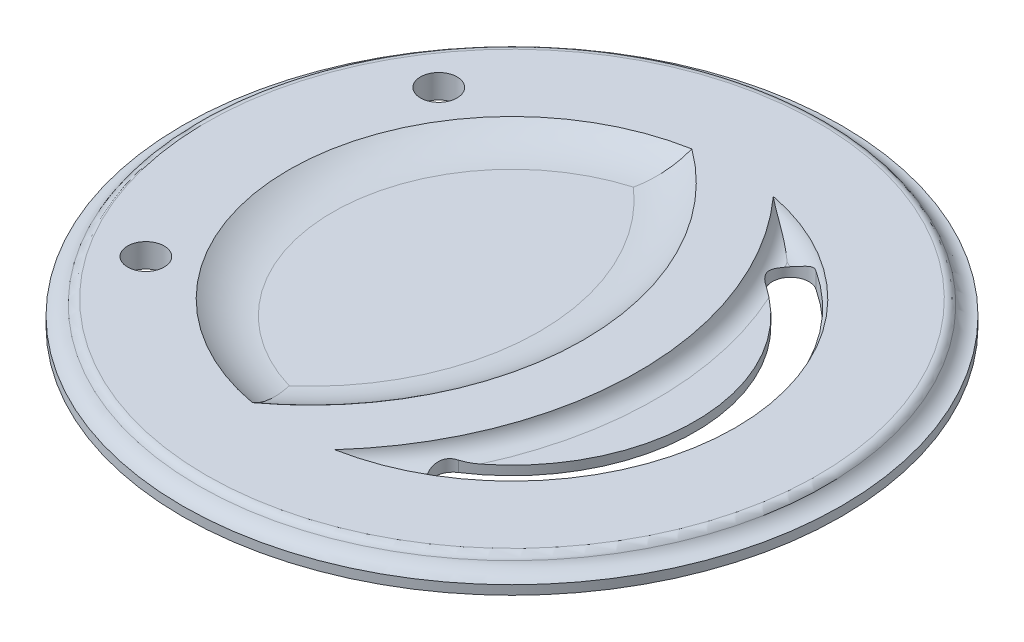
ISO-10303-21;
HEADER;
FILE_DESCRIPTION(('STEP AP214'),'2;1');
FILE_NAME('part.step','',(''),(''),'','','');
FILE_SCHEMA(('AUTOMOTIVE_DESIGN { 1 0 10303 214 1 1 1 1 }'));
ENDSEC;
DATA;
#1=APPLICATION_CONTEXT('core data for automotive mechanical design processes');
#2=APPLICATION_PROTOCOL_DEFINITION('international standard','automotive_design',2000,#1);
#3=PRODUCT_CONTEXT('',#1,'mechanical');
#4=PRODUCT('Part','Part','',(#3));
#5=PRODUCT_RELATED_PRODUCT_CATEGORY('part','',(#4));
#6=PRODUCT_DEFINITION_FORMATION('','',#4);
#7=PRODUCT_DEFINITION_CONTEXT('part definition',#1,'design');
#8=PRODUCT_DEFINITION('design','',#6,#7);
#9=PRODUCT_DEFINITION_SHAPE('','',#8);
#10=(LENGTH_UNIT() NAMED_UNIT(*) SI_UNIT(.MILLI.,.METRE.));
#11=(NAMED_UNIT(*) PLANE_ANGLE_UNIT() SI_UNIT($,.RADIAN.));
#12=(NAMED_UNIT(*) SI_UNIT($,.STERADIAN.) SOLID_ANGLE_UNIT());
#13=UNCERTAINTY_MEASURE_WITH_UNIT(LENGTH_MEASURE(1.E-05),#10,'distance_accuracy_value','');
#14=(GEOMETRIC_REPRESENTATION_CONTEXT(3) GLOBAL_UNCERTAINTY_ASSIGNED_CONTEXT((#13)) GLOBAL_UNIT_ASSIGNED_CONTEXT((#10,
#11,#12)) REPRESENTATION_CONTEXT('',''));
#15=CARTESIAN_POINT('',(0.,0.,0.));
#16=DIRECTION('',(0.,0.,1.));
#17=DIRECTION('',(1.,0.,0.));
#18=AXIS2_PLACEMENT_3D('',#15,#16,#17);
#19=CARTESIAN_POINT('',(0.,1.5875,0.));
#20=DIRECTION('',(0.,1.,0.));
#21=DIRECTION('',(0.,0.,1.));
#22=AXIS2_PLACEMENT_3D('',#19,#20,#21);
#23=PLANE('',#22);
#24=CARTESIAN_POINT('',(-34.894483527296,1.5875,0.));
#25=DIRECTION('',(0.,1.,0.));
#26=DIRECTION('',(0.,0.,1.));
#27=AXIS2_PLACEMENT_3D('',#24,#25,#26);
#28=CIRCLE('',#27,59.9120486129343);
#29=CARTESIAN_POINT('',(16.3799691108864,1.5875,30.9900641440671));
#30=VERTEX_POINT('',#29);
#31=CARTESIAN_POINT('',(15.8011891030496,1.5875,31.9280808310715));
#32=VERTEX_POINT('',#31);
#33=EDGE_CURVE('E389',#30,#32,#28,.F.);
#34=ORIENTED_EDGE('',*,*,#33,.T.);
#35=CARTESIAN_POINT('',(0.,1.5875,0.));
#36=DIRECTION('',(0.,1.,0.));
#37=DIRECTION('',(0.,0.,1.));
#38=AXIS2_PLACEMENT_3D('',#35,#36,#37);
#39=CIRCLE('',#38,35.6241480266654);
#40=CARTESIAN_POINT('',(16.7373500009291,1.5875,31.4474329249967));
#41=VERTEX_POINT('',#40);
#42=EDGE_CURVE('E157',#32,#41,#39,.T.);
#43=ORIENTED_EDGE('',*,*,#42,.T.);
#44=CARTESIAN_POINT('',(19.05,1.5875,29.2720536519049));
#45=DIRECTION('',(0.,1.,0.));
#46=DIRECTION('',(0.,0.,1.));
#47=AXIS2_PLACEMENT_3D('',#44,#45,#46);
#48=CIRCLE('',#47,3.175);
#49=EDGE_CURVE('E239',#30,#41,#48,.T.);
#50=ORIENTED_EDGE('',*,*,#49,.F.);
#51=EDGE_LOOP('',(#34,#43,#50));
#52=FACE_BOUND('',#51,.T.);
#53=ADVANCED_FACE('F43',(#52),#23,.T.);
#54=CARTESIAN_POINT('',(19.05,1.5875,-29.2720536519049));
#55=DIRECTION('',(0.,1.,0.));
#56=DIRECTION('',(0.,0.,-1.));
#57=AXIS2_PLACEMENT_3D('',#54,#55,#56);
#58=CIRCLE('',#57,3.175);
#59=CARTESIAN_POINT('',(16.7373500009291,1.5875,-31.4474329249967));
#60=VERTEX_POINT('',#59);
#61=CARTESIAN_POINT('',(16.3799691108864,1.5875,-30.9900641440671));
#62=VERTEX_POINT('',#61);
#63=EDGE_CURVE('E232',#60,#62,#58,.T.);
#64=ORIENTED_EDGE('',*,*,#63,.F.);
#65=CARTESIAN_POINT('',(0.,1.5875,0.));
#66=DIRECTION('',(0.,1.,0.));
#67=DIRECTION('',(0.,0.,1.));
#68=AXIS2_PLACEMENT_3D('',#65,#66,#67);
#69=CIRCLE('',#68,35.6241480266654);
#70=CARTESIAN_POINT('',(15.8011891030496,1.5875,-31.9280808310715));
#71=VERTEX_POINT('',#70);
#72=EDGE_CURVE('E163',#60,#71,#69,.T.);
#73=ORIENTED_EDGE('',*,*,#72,.T.);
#74=CARTESIAN_POINT('',(-34.894483527296,1.5875,0.));
#75=DIRECTION('',(0.,1.,0.));
#76=DIRECTION('',(0.,0.,1.));
#77=AXIS2_PLACEMENT_3D('',#74,#75,#76);
#78=CIRCLE('',#77,59.9120486129343);
#79=EDGE_CURVE('E236',#71,#62,#78,.F.);
#80=ORIENTED_EDGE('',*,*,#79,.T.);
#81=EDGE_LOOP('',(#64,#73,#80));
#82=FACE_BOUND('',#81,.T.);
#83=ADVANCED_FACE('F235',(#82),#23,.T.);
#84=CARTESIAN_POINT('',(0.,1.5875,0.));
#85=DIRECTION('',(0.,-1.,0.));
#86=DIRECTION('',(0.,0.,1.));
#87=AXIS2_PLACEMENT_3D('',#84,#85,#86);
#88=CIRCLE('',#87,31.75);
#89=CARTESIAN_POINT('',(19.5412849038885,1.5875,-25.0240021640236));
#90=VERTEX_POINT('',#89);
#91=CARTESIAN_POINT('',(19.5412849038885,1.5875,25.0240021640236));
#92=VERTEX_POINT('',#91);
#93=EDGE_CURVE('E238',#90,#92,#88,.T.);
#94=ORIENTED_EDGE('',*,*,#93,.F.);
#95=CARTESIAN_POINT('',(-34.894483527296,1.5875,0.));
#96=DIRECTION('',(0.,1.,0.));
#97=DIRECTION('',(0.,0.,1.));
#98=AXIS2_PLACEMENT_3D('',#95,#96,#97);
#99=CIRCLE('',#98,59.9120486129343);
#100=EDGE_CURVE('E392',#90,#92,#99,.F.);
#101=ORIENTED_EDGE('',*,*,#100,.T.);
#102=EDGE_LOOP('',(#94,#101));
#103=FACE_BOUND('',#102,.T.);
#104=ADVANCED_FACE('F325',(#103),#23,.T.);
#105=CARTESIAN_POINT('',(0.,0.,0.));
#106=DIRECTION('',(0.,1.,0.));
#107=DIRECTION('',(0.,0.,1.));
#108=AXIS2_PLACEMENT_3D('',#105,#106,#107);
#109=PLANE('',#108);
#110=CARTESIAN_POINT('',(-38.1,0.,25.4));
#111=DIRECTION('',(0.,1.,0.));
#112=DIRECTION('',(0.,0.,-1.));
#113=AXIS2_PLACEMENT_3D('',#110,#111,#112);
#114=CIRCLE('',#113,3.175);
#115=CARTESIAN_POINT('',(-38.1,0.,22.225));
#116=VERTEX_POINT('',#115);
#117=EDGE_CURVE('E270',#116,#116,#114,.T.);
#118=ORIENTED_EDGE('',*,*,#117,.T.);
#119=EDGE_LOOP('',(#118));
#120=FACE_BOUND('',#119,.T.);
#121=CARTESIAN_POINT('',(-38.1,0.,-25.4));
#122=DIRECTION('',(0.,1.,0.));
#123=DIRECTION('',(0.,0.,1.));
#124=AXIS2_PLACEMENT_3D('',#121,#122,#123);
#125=CIRCLE('',#124,3.175);
#126=CARTESIAN_POINT('',(-38.1,0.,-22.225));
#127=VERTEX_POINT('',#126);
#128=EDGE_CURVE('E273',#127,#127,#125,.T.);
#129=ORIENTED_EDGE('',*,*,#128,.T.);
#130=EDGE_LOOP('',(#129));
#131=FACE_BOUND('',#130,.T.);
#132=CARTESIAN_POINT('',(0.,0.,0.));
#133=DIRECTION('',(0.,1.,0.));
#134=DIRECTION('',(0.,0.,1.));
#135=AXIS2_PLACEMENT_3D('',#132,#133,#134);
#136=CIRCLE('',#135,57.15);
#137=CARTESIAN_POINT('',(0.,0.,57.15));
#138=VERTEX_POINT('',#137);
#139=EDGE_CURVE('E276',#138,#138,#136,.T.);
#140=ORIENTED_EDGE('',*,*,#139,.F.);
#141=EDGE_LOOP('',(#140));
#142=FACE_BOUND('',#141,.T.);
#143=CARTESIAN_POINT('',(19.05,0.,29.2720536519049));
#144=DIRECTION('',(0.,1.,0.));
#145=DIRECTION('',(0.,0.,1.));
#146=AXIS2_PLACEMENT_3D('',#143,#144,#145);
#147=CIRCLE('',#146,3.175);
#148=CARTESIAN_POINT('',(17.3181818181818,0.,26.6109578653681));
#149=VERTEX_POINT('',#148);
#150=CARTESIAN_POINT('',(20.7818181818182,0.,31.9331494384417));
#151=VERTEX_POINT('',#150);
#152=EDGE_CURVE('E250',#149,#151,#147,.T.);
#153=ORIENTED_EDGE('',*,*,#152,.T.);
#154=CARTESIAN_POINT('',(0.,0.,0.));
#155=DIRECTION('',(0.,1.,0.));
#156=DIRECTION('',(0.,0.,1.));
#157=AXIS2_PLACEMENT_3D('',#154,#155,#156);
#158=CIRCLE('',#157,38.1);
#159=CARTESIAN_POINT('',(20.7818181818182,0.,-31.9331494384417));
#160=VERTEX_POINT('',#159);
#161=EDGE_CURVE('E253',#151,#160,#158,.T.);
#162=ORIENTED_EDGE('',*,*,#161,.T.);
#163=CARTESIAN_POINT('',(19.05,0.,-29.2720536519049));
#164=DIRECTION('',(0.,1.,0.));
#165=DIRECTION('',(0.,0.,-1.));
#166=AXIS2_PLACEMENT_3D('',#163,#164,#165);
#167=CIRCLE('',#166,3.175);
#168=CARTESIAN_POINT('',(17.3181818181818,0.,-26.6109578653681));
#169=VERTEX_POINT('',#168);
#170=EDGE_CURVE('E258',#160,#169,#167,.T.);
#171=ORIENTED_EDGE('',*,*,#170,.T.);
#172=CARTESIAN_POINT('',(0.,0.,0.));
#173=DIRECTION('',(0.,-1.,0.));
#174=DIRECTION('',(0.,0.,1.));
#175=AXIS2_PLACEMENT_3D('',#172,#173,#174);
#176=CIRCLE('',#175,31.75);
#177=EDGE_CURVE('E246',#169,#149,#176,.T.);
#178=ORIENTED_EDGE('',*,*,#177,.T.);
#179=EDGE_LOOP('',(#153,#162,#171,#178));
#180=FACE_BOUND('',#179,.T.);
#181=ADVANCED_FACE('F333',(#120,#131,#142,#180),#109,.F.);
#182=CARTESIAN_POINT('',(0.,1.5875,0.));
#183=DIRECTION('',(0.,-1.,0.));
#184=DIRECTION('',(0.,0.,-1.));
#185=AXIS2_PLACEMENT_3D('',#182,#183,#184);
#186=CYLINDRICAL_SURFACE('',#185,57.15);
#187=CARTESIAN_POINT('',(0.,1.5875,0.));
#188=DIRECTION('',(0.,1.,0.));
#189=DIRECTION('',(0.,0.,1.));
#190=AXIS2_PLACEMENT_3D('',#187,#188,#189);
#191=CIRCLE('',#190,57.15);
#192=CARTESIAN_POINT('',(0.,1.5875,57.15));
#193=VERTEX_POINT('',#192);
#194=EDGE_CURVE('E277',#193,#193,#191,.T.);
#195=ORIENTED_EDGE('',*,*,#194,.F.);
#196=EDGE_LOOP('',(#195));
#197=FACE_BOUND('',#196,.T.);
#198=ORIENTED_EDGE('',*,*,#139,.T.);
#199=EDGE_LOOP('',(#198));
#200=FACE_BOUND('',#199,.T.);
#201=ADVANCED_FACE('F339',(#197,#200),#186,.T.);
#202=CARTESIAN_POINT('',(-38.1,1.5875,-25.4));
#203=DIRECTION('',(0.,-1.,0.));
#204=DIRECTION('',(0.,0.,-1.));
#205=AXIS2_PLACEMENT_3D('',#202,#203,#204);
#206=CYLINDRICAL_SURFACE('',#205,3.175);
#207=ORIENTED_EDGE('',*,*,#128,.F.);
#208=EDGE_LOOP('',(#207));
#209=FACE_BOUND('',#208,.T.);
#210=CARTESIAN_POINT('',(-38.1,4.1275,-25.4));
#211=DIRECTION('',(0.,1.,0.));
#212=DIRECTION('',(0.,0.,1.));
#213=AXIS2_PLACEMENT_3D('',#210,#211,#212);
#214=CIRCLE('',#213,3.175);
#215=CARTESIAN_POINT('',(-38.1,4.1275,-22.225));
#216=VERTEX_POINT('',#215);
#217=EDGE_CURVE('E362',#216,#216,#214,.F.);
#218=ORIENTED_EDGE('',*,*,#217,.F.);
#219=EDGE_LOOP('',(#218));
#220=FACE_BOUND('',#219,.T.);
#221=ADVANCED_FACE('F371',(#209,#220),#206,.F.);
#222=CARTESIAN_POINT('',(-38.1,1.5875,25.4));
#223=DIRECTION('',(0.,-1.,0.));
#224=DIRECTION('',(0.,0.,-1.));
#225=AXIS2_PLACEMENT_3D('',#222,#223,#224);
#226=CYLINDRICAL_SURFACE('',#225,3.175);
#227=ORIENTED_EDGE('',*,*,#117,.F.);
#228=EDGE_LOOP('',(#227));
#229=FACE_BOUND('',#228,.T.);
#230=CARTESIAN_POINT('',(-38.1,4.1275,25.4));
#231=DIRECTION('',(0.,1.,0.));
#232=DIRECTION('',(0.,0.,1.));
#233=AXIS2_PLACEMENT_3D('',#230,#231,#232);
#234=CIRCLE('',#233,3.175);
#235=CARTESIAN_POINT('',(-38.1,4.1275,28.575));
#236=VERTEX_POINT('',#235);
#237=EDGE_CURVE('E254',#236,#236,#234,.F.);
#238=ORIENTED_EDGE('',*,*,#237,.F.);
#239=EDGE_LOOP('',(#238));
#240=FACE_BOUND('',#239,.T.);
#241=ADVANCED_FACE('F218',(#229,#240),#226,.F.);
#242=CARTESIAN_POINT('',(19.05,1.5875,29.2720536519049));
#243=DIRECTION('',(0.,-1.,0.));
#244=DIRECTION('',(0.,0.,-1.));
#245=AXIS2_PLACEMENT_3D('',#242,#243,#244);
#246=CYLINDRICAL_SURFACE('',#245,3.175);
#247=ORIENTED_EDGE('',*,*,#152,.F.);
#248=DIRECTION('',(0.,-1.,0.));
#249=VECTOR('',#248,1.);
#250=CARTESIAN_POINT('',(17.3181818181818,1.5875,26.6109578653681));
#251=LINE('',#250,#249);
#252=CARTESIAN_POINT('',(17.3181818181818,1.86994398703748,26.6109578653681));
#253=VERTEX_POINT('',#252);
#254=EDGE_CURVE('E243',#253,#149,#251,.T.);
#255=ORIENTED_EDGE('',*,*,#254,.F.);
#256=CARTESIAN_POINT('',(17.3181818181818,1.86994398703748,26.6109578653681));
#257=CARTESIAN_POINT('',(17.25094832782,1.88806465306734,26.6547144690786));
#258=CARTESIAN_POINT('',(17.1853135318106,1.9059501902147,26.7010549784337));
#259=CARTESIAN_POINT('',(17.057489102705,1.94046602086241,26.7987953440393));
#260=CARTESIAN_POINT('',(16.9953023742754,1.95709526020166,26.8501993675753));
#261=CARTESIAN_POINT('',(16.8744875782775,1.98834463109139,26.9581056762938));
#262=CARTESIAN_POINT('',(16.8158751276817,2.00295625572703,27.0146279785244));
#263=CARTESIAN_POINT('',(16.7028787688804,2.02930841852981,27.1323570685501));
#264=CARTESIAN_POINT('',(16.6484937616872,2.04104970459881,27.1935626305953));
#265=CARTESIAN_POINT('',(16.5440328982232,2.06104056872029,27.3207548949813));
#266=CARTESIAN_POINT('',(16.4939863268176,2.06926769854274,27.3867692721323));
#267=CARTESIAN_POINT('',(16.3990538488385,2.08159137373899,27.5227721170388));
#268=CARTESIAN_POINT('',(16.3541673968006,2.08568835605766,27.5927601635761));
#269=CARTESIAN_POINT('',(16.2701101951929,2.08946454727096,27.7359211656408));
#270=CARTESIAN_POINT('',(16.2309223574959,2.0891572510261,27.809083707802));
#271=CARTESIAN_POINT('',(16.1584525887262,2.08419069659384,27.9581077719284));
#272=CARTESIAN_POINT('',(16.125170330944,2.07953167924243,28.0339691443095));
#273=CARTESIAN_POINT('',(16.0402763495138,2.06071262107193,28.2500485392156));
#274=CARTESIAN_POINT('',(15.995626042724,2.04191508478862,28.3926691835874));
#275=CARTESIAN_POINT('',(15.9268975361637,1.99462130932278,28.6813070273414));
#276=CARTESIAN_POINT('',(15.9028586098096,1.96610669875561,28.827330168789));
#277=CARTESIAN_POINT('',(15.87384893122,1.9011326132911,29.134811395151));
#278=CARTESIAN_POINT('',(15.8710092670667,1.86416532563888,29.2963619785586));
#279=CARTESIAN_POINT('',(15.8898055692093,1.79082220568835,29.6181929992641));
#280=CARTESIAN_POINT('',(15.9114493504522,1.75444656600031,29.778473014557));
#281=CARTESIAN_POINT('',(15.9778746632602,1.69005320217331,30.0885324010756));
#282=CARTESIAN_POINT('',(16.0216126395107,1.66174154936936,30.238465792362));
#283=CARTESIAN_POINT('',(16.1038422904137,1.62821726313603,30.4581802929004));
#284=CARTESIAN_POINT('',(16.1339845538534,1.61853821032115,30.5304851134661));
#285=CARTESIAN_POINT('',(16.1997024336669,1.60279717665847,30.6729706558994));
#286=CARTESIAN_POINT('',(16.2352741493274,1.59673261425213,30.743152859702));
#287=CARTESIAN_POINT('',(16.290215955294,1.5910577763892,30.8422175487932));
#288=CARTESIAN_POINT('',(16.3074849019525,1.58973521881799,30.8721891172337));
#289=CARTESIAN_POINT('',(16.3429993673698,1.58795642809081,30.9315620784083));
#290=CARTESIAN_POINT('',(16.3612446002359,1.58749994272889,30.9609636346643));
#291=CARTESIAN_POINT('',(16.3799691108864,1.5875,30.9900641440671));
#292=B_SPLINE_CURVE_WITH_KNOTS('',3,(#256,#257,#258,#259,#260,#261,#262,#263,#264,#265,#266,
#267,#268,#269,#270,#271,#272,#273,#274,#275,#276,#277,#278,#279,#280,#281,#282,#283,#284,#285,
#286,#287,#288,#289,#290,#291),.UNSPECIFIED.,.F.,.F.,(4,2,2,2,2,2,2,2,2,2,2,2,2,2,2,2,2,4),(0.,
0.246687476584796,0.493579701379996,0.741483037565163,0.989321710488392,1.23872070871003,
1.4880933192409,1.73670200732528,1.98529693754892,2.43505659097187,2.88567133471481,
3.38104313702788,3.876573103237,4.35062461172809,4.5871820586252,4.8235703472353,
4.92739377861893,5.03118697128996),.UNSPECIFIED.);
#293=EDGE_CURVE('E206',#253,#30,#292,.T.);
#294=ORIENTED_EDGE('',*,*,#293,.T.);
#295=ORIENTED_EDGE('',*,*,#49,.T.);
#296=CARTESIAN_POINT('',(16.7373500009291,1.5875,31.4474329249967));
#297=CARTESIAN_POINT('',(16.7904691916283,1.58748498400425,31.5039315710093));
#298=CARTESIAN_POINT('',(16.8456601704396,1.59014468143661,31.5584321885097));
#299=CARTESIAN_POINT('',(16.959553298189,1.60037526632466,31.6629936568732));
#300=CARTESIAN_POINT('',(17.0182510066419,1.60794005742555,31.7130599313385));
#301=CARTESIAN_POINT('',(17.1381462184216,1.62746108980537,31.8080442011369));
#302=CARTESIAN_POINT('',(17.1993181274159,1.63937932135567,31.8530024686496));
#303=CARTESIAN_POINT('',(17.3241006003064,1.66712195569449,31.938062659079));
#304=CARTESIAN_POINT('',(17.3877118472533,1.68294745942368,31.9781632084956));
#305=CARTESIAN_POINT('',(17.5808316236171,1.7353599525437,32.090608387346));
#306=CARTESIAN_POINT('',(17.7133107379934,1.77700390143068,32.155633103255));
#307=CARTESIAN_POINT('',(17.9831406252001,1.86987744832906,32.2660123162901));
#308=CARTESIAN_POINT('',(18.1205012979428,1.92112754660146,32.3113240445241));
#309=CARTESIAN_POINT('',(18.4169865421222,2.03686736121477,32.387573656939));
#310=CARTESIAN_POINT('',(18.5765051353282,2.10220849535343,32.4156758847772));
#311=CARTESIAN_POINT('',(18.897333983219,2.23492725834028,32.4474837725959));
#312=CARTESIAN_POINT('',(19.058646440694,2.30230762002966,32.4511550926438));
#313=CARTESIAN_POINT('',(19.3741613328715,2.42960124860942,32.4342291438874));
#314=CARTESIAN_POINT('',(19.5283419520498,2.48971657593888,32.4147633403717));
#315=CARTESIAN_POINT('',(19.8355402648498,2.59842999905108,32.3522937147818));
#316=CARTESIAN_POINT('',(19.9885598151888,2.64708688039819,32.309413953729));
#317=CARTESIAN_POINT('',(20.1946464082268,2.69944106235585,32.2341230972367));
#318=CARTESIAN_POINT('',(20.2494495995977,2.71206224674831,32.2123696812988));
#319=CARTESIAN_POINT('',(20.3582842284622,2.73412899363447,32.1655846423539));
#320=CARTESIAN_POINT('',(20.4123159671906,2.74357583001968,32.1405543400052));
#321=CARTESIAN_POINT('',(20.5198143111754,2.75897273909674,32.0869971952342));
#322=CARTESIAN_POINT('',(20.57327010159,2.76488743859112,32.0584383293698));
#323=CARTESIAN_POINT('',(20.6787424433466,2.77284073439229,31.9981382008397));
#324=CARTESIAN_POINT('',(20.7307570372493,2.77487429141538,31.9663928570274));
#325=CARTESIAN_POINT('',(20.7818181818182,2.77484258330678,31.9331494384417));
#326=B_SPLINE_CURVE_WITH_KNOTS('',3,(#296,#297,#298,#299,#300,#301,#302,#303,#304,#305,#306,
#307,#308,#309,#310,#311,#312,#313,#314,#315,#316,#317,#318,#319,#320,#321,#322,#323,#324,#325),
.UNSPECIFIED.,.F.,.F.,(4,2,2,2,2,2,2,2,2,2,2,2,2,2,4),(0.,0.232492347017282,0.46469629055287,
0.694919522244584,0.925207697442907,1.3831829563334,1.84214693310489,2.36426254094147,
2.88711187651219,3.38541020691803,3.88109352262553,4.06184794309392,4.24252973847883,
4.4249919128055,4.60769083566614),.UNSPECIFIED.);
#327=CARTESIAN_POINT('',(20.7818181818182,2.77484258330689,31.9331494384417));
#328=VERTEX_POINT('',#327);
#329=EDGE_CURVE('E161',#41,#328,#326,.T.);
#330=ORIENTED_EDGE('',*,*,#329,.T.);
#331=DIRECTION('',(0.,-1.,0.));
#332=VECTOR('',#331,1.);
#333=CARTESIAN_POINT('',(20.7818181818182,1.5875,31.9331494384417));
#334=LINE('',#333,#332);
#335=EDGE_CURVE('E70',#328,#151,#334,.T.);
#336=ORIENTED_EDGE('',*,*,#335,.T.);
#337=EDGE_LOOP('',(#247,#255,#294,#295,#330,#336));
#338=FACE_BOUND('',#337,.T.);
#339=ADVANCED_FACE('F212',(#338),#246,.F.);
#340=CARTESIAN_POINT('',(0.,1.5875,0.));
#341=DIRECTION('',(0.,-1.,0.));
#342=DIRECTION('',(0.,0.,-1.));
#343=AXIS2_PLACEMENT_3D('',#340,#341,#342);
#344=CYLINDRICAL_SURFACE('',#343,38.1);
#345=ORIENTED_EDGE('',*,*,#161,.F.);
#346=ORIENTED_EDGE('',*,*,#335,.F.);
#347=CARTESIAN_POINT('',(0.,2.77484258330689,0.));
#348=DIRECTION('',(0.,-1.,0.));
#349=DIRECTION('',(0.,0.,-1.));
#350=AXIS2_PLACEMENT_3D('',#347,#348,#349);
#351=CIRCLE('',#350,38.1);
#352=CARTESIAN_POINT('',(20.7818181818182,2.7748425833069,-31.9331494384417));
#353=VERTEX_POINT('',#352);
#354=EDGE_CURVE('E57',#328,#353,#351,.F.);
#355=ORIENTED_EDGE('',*,*,#354,.T.);
#356=DIRECTION('',(0.,-1.,0.));
#357=VECTOR('',#356,1.);
#358=CARTESIAN_POINT('',(20.7818181818182,1.5875,-31.9331494384417));
#359=LINE('',#358,#357);
#360=EDGE_CURVE('E63',#353,#160,#359,.T.);
#361=ORIENTED_EDGE('',*,*,#360,.T.);
#362=EDGE_LOOP('',(#345,#346,#355,#361));
#363=FACE_BOUND('',#362,.T.);
#364=ADVANCED_FACE('F217',(#363),#344,.F.);
#365=CARTESIAN_POINT('',(19.05,1.5875,-29.2720536519049));
#366=DIRECTION('',(0.,-1.,0.));
#367=DIRECTION('',(0.,0.,-1.));
#368=AXIS2_PLACEMENT_3D('',#365,#366,#367);
#369=CYLINDRICAL_SURFACE('',#368,3.175);
#370=ORIENTED_EDGE('',*,*,#170,.F.);
#371=ORIENTED_EDGE('',*,*,#360,.F.);
#372=CARTESIAN_POINT('',(20.7818181818182,2.7748425833069,-31.9331494384417));
#373=CARTESIAN_POINT('',(20.7181502285692,2.77491508603704,-31.9746144385452));
#374=CARTESIAN_POINT('',(20.6530090565294,2.77172980968801,-32.0137248789055));
#375=CARTESIAN_POINT('',(20.5206961531758,2.75941847855317,-32.0868954091583));
#376=CARTESIAN_POINT('',(20.4535299355965,2.75030737195119,-32.1209679426896));
#377=CARTESIAN_POINT('',(20.3186713648553,2.72687305726484,-32.1835074743956));
#378=CARTESIAN_POINT('',(20.2509983407694,2.71262183852261,-32.2120439079364));
#379=CARTESIAN_POINT('',(20.1147561687133,2.67973610515592,-32.2640829932835));
#380=CARTESIAN_POINT('',(20.0461864323425,2.66109856036721,-32.2875821436903));
#381=CARTESIAN_POINT('',(19.8933419944276,2.61581744041081,-32.334262357435));
#382=CARTESIAN_POINT('',(19.8089494502441,2.58831487266393,-32.3562225151048));
#383=CARTESIAN_POINT('',(19.6399189245206,2.52963209656284,-32.392967714029));
#384=CARTESIAN_POINT('',(19.5552809012258,2.49845122182844,-32.4077514526791));
#385=CARTESIAN_POINT('',(19.3004135263423,2.40106688592413,-32.4418215029766));
#386=CARTESIAN_POINT('',(19.1300593872394,2.33129272270783,-32.4505795103068));
#387=CARTESIAN_POINT('',(18.7871907958733,2.18949998637261,-32.4408985044046));
#388=CARTESIAN_POINT('',(18.6147019108983,2.1174645098404,-32.4219083254528));
#389=CARTESIAN_POINT('',(18.2729372492301,1.9797049064271,-32.3553909085459));
#390=CARTESIAN_POINT('',(18.1036554326827,1.91396771525705,-32.3079242925487));
#391=CARTESIAN_POINT('',(17.7993474306328,1.80547480236782,-32.1940846175566));
#392=CARTESIAN_POINT('',(17.6633499757339,1.76071333334211,-32.1322365631472));
#393=CARTESIAN_POINT('',(17.398843900189,1.68438795611011,-31.9880911890462));
#394=CARTESIAN_POINT('',(17.2703170877568,1.65279072415206,-31.9058463547606));
#395=CARTESIAN_POINT('',(17.074611584358,1.61620369083453,-31.7593750733791));
#396=CARTESIAN_POINT('',(17.0037317789352,1.60561919142839,-31.7014131568766));
#397=CARTESIAN_POINT('',(16.8667111926594,1.59124905264866,-31.5790796432134));
#398=CARTESIAN_POINT('',(16.800581687603,1.58747910811316,-31.5146936090887));
#399=CARTESIAN_POINT('',(16.7373500009291,1.5875,-31.4474329249967));
#400=B_SPLINE_CURVE_WITH_KNOTS('',3,(#372,#373,#374,#375,#376,#377,#378,#379,#380,#381,#382,
#383,#384,#385,#386,#387,#388,#389,#390,#391,#392,#393,#394,#395,#396,#397,#398,#399),
.UNSPECIFIED.,.F.,.F.,(4,2,2,2,2,2,2,2,2,2,2,2,2,4),(0.,0.227744373676276,0.454916468100954,
0.679023176319381,0.90328515886656,1.17716947386,1.45110348350468,2.00165695036251,
2.56329587231946,3.12374337313697,3.58989063907108,4.05485063002698,4.33081691651483,
4.6074179846243),.UNSPECIFIED.);
#401=EDGE_CURVE('E11',#353,#60,#400,.T.);
#402=ORIENTED_EDGE('',*,*,#401,.T.);
#403=ORIENTED_EDGE('',*,*,#63,.T.);
#404=CARTESIAN_POINT('',(16.3799691108864,1.5875,-30.9900641440671));
#405=CARTESIAN_POINT('',(16.3346510343391,1.58748667922355,-30.9196653997991));
#406=CARTESIAN_POINT('',(16.2921751221623,1.59017050967053,-30.8475012778364));
#407=CARTESIAN_POINT('',(16.2132100869189,1.60017461010562,-30.7004011988184));
#408=CARTESIAN_POINT('',(16.1767125321342,1.60748827817123,-30.6254693314645));
#409=CARTESIAN_POINT('',(16.1101408822593,1.62592516358049,-30.4739906023445));
#410=CARTESIAN_POINT('',(16.0800182238501,1.63701776471743,-30.3974612214171));
#411=CARTESIAN_POINT('',(16.0259133678563,1.66223872476071,-30.2427481602395));
#412=CARTESIAN_POINT('',(16.0019333201894,1.67636814338177,-30.1645639111216));
#413=CARTESIAN_POINT('',(15.9395037956149,1.72196231697831,-29.9290811440668));
#414=CARTESIAN_POINT('',(15.910162121423,1.75676344567884,-29.769926782204));
#415=CARTESIAN_POINT('',(15.8758209208386,1.82907926375708,-29.4492292136748));
#416=CARTESIAN_POINT('',(15.8709059401889,1.86660292247214,-29.2876796484778));
#417=CARTESIAN_POINT('',(15.8867097842267,1.9421608794056,-28.9449428769837));
#418=CARTESIAN_POINT('',(15.9106165179713,1.97970301537328,-28.7637551508426));
#419=CARTESIAN_POINT('',(15.969982723022,2.02545556705187,-28.4958572016138));
#420=CARTESIAN_POINT('',(15.9936468277129,2.03893646576416,-28.4073088058227));
#421=CARTESIAN_POINT('',(16.0487563134172,2.06146226158741,-28.2320622164761));
#422=CARTESIAN_POINT('',(16.0802000257597,2.07050810874657,-28.1453636304757));
#423=CARTESIAN_POINT('',(16.1475533252974,2.08286240306366,-27.9822823178427));
#424=CARTESIAN_POINT('',(16.1828198925487,2.08660838497011,-27.9056664439016));
#425=CARTESIAN_POINT('',(16.2593825790927,2.0895540258934,-27.7554169043675));
#426=CARTESIAN_POINT('',(16.3006784455705,2.08875387548114,-27.6817831138978));
#427=CARTESIAN_POINT('',(16.3890498117909,2.0826509725554,-27.5379506059068));
#428=CARTESIAN_POINT('',(16.436142795645,2.07733429889402,-27.4677632194449));
#429=CARTESIAN_POINT('',(16.5355151412554,2.06256215464383,-27.3316668374903));
#430=CARTESIAN_POINT('',(16.5877943547033,2.05310680238067,-27.2657577197429));
#431=CARTESIAN_POINT('',(16.7414962155984,2.02152314426128,-27.0869985613933));
#432=CARTESIAN_POINT('',(16.8483773280196,1.99533693323179,-26.9794489578687));
#433=CARTESIAN_POINT('',(17.0180309677047,1.9510468328299,-26.8312829122525));
#434=CARTESIAN_POINT('',(17.0760054244488,1.93548640892102,-26.7841729236044));
#435=CARTESIAN_POINT('',(17.194912586279,1.90333264146834,-26.6943020261877));
#436=CARTESIAN_POINT('',(17.2558436935683,1.88673985448304,-26.6515388062232));
#437=CARTESIAN_POINT('',(17.3181818181818,1.86994398703749,-26.6109578653681));
#438=B_SPLINE_CURVE_WITH_KNOTS('',3,(#404,#405,#406,#407,#408,#409,#410,#411,#412,#413,#414,
#415,#416,#417,#418,#419,#420,#421,#422,#423,#424,#425,#426,#427,#428,#429,#430,#431,#432,#433,
#434,#435,#436,#437),.UNSPECIFIED.,.F.,.F.,(4,2,2,2,2,2,2,2,2,2,2,2,2,2,2,2,4),(0.,
0.250983682726575,0.501610278662648,0.750252817554182,0.998982262952177,1.49342329252426,
1.98957449671872,2.54602370920162,2.82358482837653,3.10108646418881,3.35398731510338,
3.6068775646568,3.86055013050757,4.11421544428267,4.57368669675413,4.80245894983435,
5.03110892033437),.UNSPECIFIED.);
#439=CARTESIAN_POINT('',(17.3181818181818,1.86994398703749,-26.6109578653681));
#440=VERTEX_POINT('',#439);
#441=EDGE_CURVE('E185',#62,#440,#438,.T.);
#442=ORIENTED_EDGE('',*,*,#441,.T.);
#443=DIRECTION('',(0.,-1.,0.));
#444=VECTOR('',#443,1.);
#445=CARTESIAN_POINT('',(17.3181818181818,1.5875,-26.6109578653681));
#446=LINE('',#445,#444);
#447=EDGE_CURVE('E266',#440,#169,#446,.T.);
#448=ORIENTED_EDGE('',*,*,#447,.T.);
#449=EDGE_LOOP('',(#370,#371,#402,#403,#442,#448));
#450=FACE_BOUND('',#449,.T.);
#451=ADVANCED_FACE('F230',(#450),#369,.F.);
#452=CARTESIAN_POINT('',(0.,1.5875,0.));
#453=DIRECTION('',(0.,-1.,0.));
#454=DIRECTION('',(0.,0.,-1.));
#455=AXIS2_PLACEMENT_3D('',#452,#453,#454);
#456=CYLINDRICAL_SURFACE('',#455,31.75);
#457=ORIENTED_EDGE('',*,*,#177,.F.);
#458=ORIENTED_EDGE('',*,*,#447,.F.);
#459=CARTESIAN_POINT('',(17.3181818181818,1.86994398703749,-26.6109578653681));
#460=CARTESIAN_POINT('',(17.4121218925222,1.84463541891172,-26.5498235360022));
#461=CARTESIAN_POINT('',(17.506096411595,1.82129478112356,-26.4879564637586));
#462=CARTESIAN_POINT('',(17.6939518373826,1.77831708413163,-26.3628392092829));
#463=CARTESIAN_POINT('',(17.7878327561889,1.7586794606027,-26.2995892394412));
#464=CARTESIAN_POINT('',(18.0684705129918,1.70508895739791,-26.1083127210239));
#465=CARTESIAN_POINT('',(18.2548895125871,1.67628269299157,-25.9783256840048));
#466=CARTESIAN_POINT('',(18.625855074275,1.63099298602452,-25.7136531785092));
#467=CARTESIAN_POINT('',(18.8104015392737,1.61451017926619,-25.5789674679898));
#468=CARTESIAN_POINT('',(19.085621142364,1.59819646802989,-25.3735047760223));
#469=CARTESIAN_POINT('',(19.1772564586103,1.59416067065282,-25.304318272499));
#470=CARTESIAN_POINT('',(19.3598166843575,1.5888136242033,-25.1649198193659));
#471=CARTESIAN_POINT('',(19.4507416315807,1.58750222946556,-25.0947079247827));
#472=CARTESIAN_POINT('',(19.5412849038885,1.5875,-25.0240021640236));
#473=B_SPLINE_CURVE_WITH_KNOTS('',3,(#459,#460,#461,#462,#463,#464,#465,#466,#467,#468,#469,
#470,#471,#472),.UNSPECIFIED.,.F.,.F.,(4,2,2,2,2,2,4),(0.,0.344663597068182,0.689274626202587,
1.37605656277092,2.06287392993651,2.40751520103609,2.75213804477261),.UNSPECIFIED.);
#474=EDGE_CURVE('E193',#440,#90,#473,.T.);
#475=ORIENTED_EDGE('',*,*,#474,.T.);
#476=ORIENTED_EDGE('',*,*,#93,.T.);
#477=CARTESIAN_POINT('',(19.5412849038885,1.5875,25.0240021640236));
#478=CARTESIAN_POINT('',(19.4507416315807,1.58750222946556,25.0947079247827));
#479=CARTESIAN_POINT('',(19.3598166843575,1.5888136242033,25.1649198193659));
#480=CARTESIAN_POINT('',(19.1772564586103,1.59416067065282,25.304318272499));
#481=CARTESIAN_POINT('',(19.085621142364,1.59819646802989,25.3735047760223));
#482=CARTESIAN_POINT('',(18.8104015392737,1.61451017926619,25.5789674679898));
#483=CARTESIAN_POINT('',(18.625855074275,1.63099298602451,25.7136531785092));
#484=CARTESIAN_POINT('',(18.2548895125871,1.67628269299157,25.9783256840048));
#485=CARTESIAN_POINT('',(18.0684705129918,1.70508895739791,26.1083127210239));
#486=CARTESIAN_POINT('',(17.7878327561889,1.7586794606027,26.2995892394412));
#487=CARTESIAN_POINT('',(17.6939518373826,1.77831708413162,26.3628392092829));
#488=CARTESIAN_POINT('',(17.5060964115951,1.82129478112354,26.4879564637586));
#489=CARTESIAN_POINT('',(17.4121218925222,1.84463541891169,26.5498235360022));
#490=CARTESIAN_POINT('',(17.3181818181818,1.86994398703743,26.6109578653681));
#491=B_SPLINE_CURVE_WITH_KNOTS('',3,(#477,#478,#479,#480,#481,#482,#483,#484,#485,#486,#487,
#488,#489,#490),.UNSPECIFIED.,.F.,.F.,(4,2,2,2,2,2,4),(0.,0.344622843736522,0.689264114836092,
1.37608148200167,2.06286341857001,2.40747444770441,2.75213804477259),.UNSPECIFIED.);
#492=EDGE_CURVE('E200',#92,#253,#491,.T.);
#493=ORIENTED_EDGE('',*,*,#492,.T.);
#494=ORIENTED_EDGE('',*,*,#254,.T.);
#495=EDGE_LOOP('',(#457,#458,#475,#476,#493,#494));
#496=FACE_BOUND('',#495,.T.);
#497=ADVANCED_FACE('F348',(#496),#456,.T.);
#498=CARTESIAN_POINT('',(0.,4.1275,0.));
#499=DIRECTION('',(0.,1.,0.));
#500=DIRECTION('',(0.,0.,1.));
#501=AXIS2_PLACEMENT_3D('',#498,#499,#500);
#502=PLANE('',#501);
#503=CARTESIAN_POINT('',(0.,4.1275,0.));
#504=DIRECTION('',(0.,1.,0.));
#505=DIRECTION('',(0.,0.,1.));
#506=AXIS2_PLACEMENT_3D('',#503,#504,#505);
#507=CIRCLE('',#506,53.0225);
#508=CARTESIAN_POINT('',(0.,4.1275,53.0225));
#509=VERTEX_POINT('',#508);
#510=EDGE_CURVE('E291',#509,#509,#507,.T.);
#511=ORIENTED_EDGE('',*,*,#510,.T.);
#512=EDGE_LOOP('',(#511));
#513=FACE_BOUND('',#512,.T.);
#514=CARTESIAN_POINT('',(0.,4.1275,0.));
#515=DIRECTION('',(0.,1.,0.));
#516=DIRECTION('',(0.,0.,1.));
#517=AXIS2_PLACEMENT_3D('',#514,#515,#516);
#518=CIRCLE('',#517,38.735);
#519=CARTESIAN_POINT('',(7.28411317015311,4.1275,38.0439472232365));
#520=VERTEX_POINT('',#519);
#521=CARTESIAN_POINT('',(7.28411317015311,4.1275,-38.0439472232365));
#522=VERTEX_POINT('',#521);
#523=EDGE_CURVE('E134',#520,#522,#518,.T.);
#524=ORIENTED_EDGE('',*,*,#523,.F.);
#525=CARTESIAN_POINT('',(-34.894483527296,4.1275,0.));
#526=DIRECTION('',(0.,1.,0.));
#527=DIRECTION('',(0.,0.,1.));
#528=AXIS2_PLACEMENT_3D('',#525,#526,#527);
#529=CIRCLE('',#528,56.8011966395996);
#530=EDGE_CURVE('E138',#520,#522,#529,.T.);
#531=ORIENTED_EDGE('',*,*,#530,.T.);
#532=EDGE_LOOP('',(#524,#531));
#533=FACE_BOUND('',#532,.T.);
#534=CARTESIAN_POINT('',(-34.894483527296,4.1275,0.));
#535=DIRECTION('',(0.,1.,0.));
#536=DIRECTION('',(0.,0.,1.));
#537=AXIS2_PLACEMENT_3D('',#534,#535,#536);
#538=CIRCLE('',#537,47.2761966395996);
#539=CARTESIAN_POINT('',(-6.92067037692112,4.1275,38.1117376477904));
#540=VERTEX_POINT('',#539);
#541=CARTESIAN_POINT('',(-6.92067037692112,4.1275,-38.1117376477904));
#542=VERTEX_POINT('',#541);
#543=EDGE_CURVE('E153',#540,#542,#538,.T.);
#544=ORIENTED_EDGE('',*,*,#543,.F.);
#545=CARTESIAN_POINT('',(0.,4.1275,0.));
#546=DIRECTION('',(0.,1.,0.));
#547=DIRECTION('',(0.,0.,1.));
#548=AXIS2_PLACEMENT_3D('',#545,#546,#547);
#549=CIRCLE('',#548,38.735);
#550=EDGE_CURVE('E356',#542,#540,#549,.T.);
#551=ORIENTED_EDGE('',*,*,#550,.F.);
#552=EDGE_LOOP('',(#544,#551));
#553=FACE_BOUND('',#552,.T.);
#554=ORIENTED_EDGE('',*,*,#217,.T.);
#555=EDGE_LOOP('',(#554));
#556=FACE_BOUND('',#555,.T.);
#557=ORIENTED_EDGE('',*,*,#237,.T.);
#558=EDGE_LOOP('',(#557));
#559=FACE_BOUND('',#558,.T.);
#560=ADVANCED_FACE('F136',(#513,#533,#553,#556,#559),#502,.T.);
#561=CARTESIAN_POINT('',(0.,1.5875,0.));
#562=DIRECTION('',(0.,1.,0.));
#563=DIRECTION('',(0.,0.,1.));
#564=AXIS2_PLACEMENT_3D('',#561,#562,#563);
#565=CIRCLE('',#564,31.115);
#566=CARTESIAN_POINT('',(-8.78583391610455,1.5875,-29.8488248914196));
#567=VERTEX_POINT('',#566);
#568=CARTESIAN_POINT('',(-8.78583391610455,1.5875,29.8488248914196));
#569=VERTEX_POINT('',#568);
#570=EDGE_CURVE('E281',#567,#569,#565,.T.);
#571=ORIENTED_EDGE('',*,*,#570,.T.);
#572=CARTESIAN_POINT('',(-34.894483527296,1.5875,0.));
#573=DIRECTION('',(0.,1.,0.));
#574=DIRECTION('',(0.,0.,1.));
#575=AXIS2_PLACEMENT_3D('',#572,#573,#574);
#576=CIRCLE('',#575,39.6561966395996);
#577=EDGE_CURVE('E287',#569,#567,#576,.T.);
#578=ORIENTED_EDGE('',*,*,#577,.T.);
#579=EDGE_LOOP('',(#571,#578));
#580=FACE_BOUND('',#579,.T.);
#581=ADVANCED_FACE('F330',(#580),#23,.T.);
#582=CARTESIAN_POINT('',(0.,14.2875,0.));
#583=DIRECTION('',(0.,-1.,0.));
#584=DIRECTION('',(0.,0.,-1.));
#585=AXIS2_PLACEMENT_3D('',#582,#583,#584);
#586=TOROIDAL_SURFACE('',#585,31.115,12.7);
#587=CARTESIAN_POINT('',(-6.92067037692112,4.1275,-38.1117376477904));
#588=CARTESIAN_POINT('',(-6.95845046779886,4.01173871628379,-37.9480049062538));
#589=CARTESIAN_POINT('',(-6.99677637268079,3.899802081643,-37.7817332880708));
#590=CARTESIAN_POINT('',(-7.07442695640139,3.68367777583041,-37.4444703786848));
#591=CARTESIAN_POINT('',(-7.11375156605251,3.57948956982236,-37.2734794143545));
#592=CARTESIAN_POINT('',(-7.23304024520571,3.27880467895863,-36.7541559885249));
#593=CARTESIAN_POINT('',(-7.3143686858961,3.09403647518494,-36.3992584936314));
#594=CARTESIAN_POINT('',(-7.47960542198517,2.75694391587243,-35.6762038729354));
#595=CARTESIAN_POINT('',(-7.56350660720296,2.60453800143555,-35.3080828805662));
#596=CARTESIAN_POINT('',(-7.73333994483054,2.33175522245501,-34.5606226035871));
#597=CARTESIAN_POINT('',(-7.81927202330942,2.2113771939447,-34.1812837272177));
#598=CARTESIAN_POINT('',(-7.97802601508438,2.01994287077179,-33.4780623665493));
#599=CARTESIAN_POINT('',(-8.0506518801497,1.94401365460887,-33.1554472555013));
#600=CARTESIAN_POINT('',(-8.19641133260397,1.81416201151214,-32.5059316548514));
#601=CARTESIAN_POINT('',(-8.26954491184767,1.76023923235527,-32.1790312339244));
#602=CARTESIAN_POINT('',(-8.41583099420665,1.67417236957904,-31.5229107500693));
#603=CARTESIAN_POINT('',(-8.48898331848434,1.64199704234807,-31.1936947043972));
#604=CARTESIAN_POINT('',(-8.63504606566733,1.59892506714797,-30.5339089722564));
#605=CARTESIAN_POINT('',(-8.70795656762268,1.58802060011011,-30.203339827976));
#606=CARTESIAN_POINT('',(-8.7823254060285,1.58750606276616,-29.8647986378752));
#607=CARTESIAN_POINT('',(-8.78407974885357,1.58749999656863,-29.8568117550116));
#608=CARTESIAN_POINT('',(-8.78583391610454,1.5875,-29.8488248914196));
#609=B_SPLINE_CURVE_WITH_KNOTS('',3,(#587,#588,#589,#590,#591,#592,#593,#594,#595,#596,#597,
#598,#599,#600,#601,#602,#603,#604,#605,#606,#607,#608),.UNSPECIFIED.,.F.,.F.,(4,2,2,2,2,2,2,2,
2,2,4),(0.,0.612037847335442,1.22403340939669,2.44722611787678,3.66729857673476,
4.88732668930945,5.90448323007382,6.9216234901448,7.93729934556728,8.9526017728842,
8.97713362859727),.UNSPECIFIED.);
#610=EDGE_CURVE('E292',#542,#567,#609,.T.);
#611=ORIENTED_EDGE('',*,*,#610,.F.);
#612=ORIENTED_EDGE('',*,*,#550,.T.);
#613=CARTESIAN_POINT('',(-6.92067037692112,4.1275,38.1117376477904));
#614=CARTESIAN_POINT('',(-6.95845046779886,4.01173871628379,37.9480049062539));
#615=CARTESIAN_POINT('',(-6.99677637268079,3.899802081643,37.7817332880708));
#616=CARTESIAN_POINT('',(-7.07442695640139,3.68367777583041,37.4444703786848));
#617=CARTESIAN_POINT('',(-7.11375156605251,3.57948956982236,37.2734794143545));
#618=CARTESIAN_POINT('',(-7.23304024520571,3.27880467895863,36.7541559885249));
#619=CARTESIAN_POINT('',(-7.3143686858961,3.09403647518494,36.3992584936314));
#620=CARTESIAN_POINT('',(-7.47960542198517,2.75694391587243,35.6762038729354));
#621=CARTESIAN_POINT('',(-7.56350660720296,2.60453800143555,35.3080828805662));
#622=CARTESIAN_POINT('',(-7.73333994483054,2.33175522245501,34.5606226035871));
#623=CARTESIAN_POINT('',(-7.81927202330942,2.2113771939447,34.1812837272177));
#624=CARTESIAN_POINT('',(-7.97802601508438,2.01994287077179,33.4780623665493));
#625=CARTESIAN_POINT('',(-8.0506518801497,1.94401365460887,33.1554472555013));
#626=CARTESIAN_POINT('',(-8.19641133260396,1.81416201151214,32.5059316548514));
#627=CARTESIAN_POINT('',(-8.26954491184766,1.76023923235527,32.1790312339244));
#628=CARTESIAN_POINT('',(-8.41583099420664,1.67417236957904,31.5229107500693));
#629=CARTESIAN_POINT('',(-8.48898331848435,1.64199704234807,31.1936947043972));
#630=CARTESIAN_POINT('',(-8.63504606566732,1.59892506714797,30.5339089722564));
#631=CARTESIAN_POINT('',(-8.70795656762264,1.58802060011011,30.203339827976));
#632=CARTESIAN_POINT('',(-8.7823254060285,1.58750606276616,29.8647986378752));
#633=CARTESIAN_POINT('',(-8.78407974885358,1.58749999656863,29.8568117550116));
#634=CARTESIAN_POINT('',(-8.78583391610454,1.5875,29.8488248914196));
#635=B_SPLINE_CURVE_WITH_KNOTS('',3,(#613,#614,#615,#616,#617,#618,#619,#620,#621,#622,#623,
#624,#625,#626,#627,#628,#629,#630,#631,#632,#633,#634),.UNSPECIFIED.,.F.,.F.,(4,2,2,2,2,2,2,2,
2,2,4),(0.,0.612037847335434,1.22403340939669,2.44722611787678,3.66729857673476,
4.88732668930945,5.90448323007383,6.9216234901448,7.93729934556728,8.9526017728842,
8.97713362859727),.UNSPECIFIED.);
#636=EDGE_CURVE('E143',#569,#540,#635,.F.);
#637=ORIENTED_EDGE('',*,*,#636,.F.);
#638=ORIENTED_EDGE('',*,*,#570,.F.);
#639=EDGE_LOOP('',(#611,#612,#637,#638));
#640=FACE_BOUND('',#639,.T.);
#641=ADVANCED_FACE('F305',(#640),#586,.F.);
#642=CARTESIAN_POINT('',(-34.894483527296,14.2875,0.));
#643=DIRECTION('',(0.,-1.,0.));
#644=DIRECTION('',(0.,0.,-1.));
#645=AXIS2_PLACEMENT_3D('',#642,#643,#644);
#646=TOROIDAL_SURFACE('',#645,39.6561966395996,12.7);
#647=ORIENTED_EDGE('',*,*,#636,.T.);
#648=ORIENTED_EDGE('',*,*,#543,.T.);
#649=ORIENTED_EDGE('',*,*,#610,.T.);
#650=ORIENTED_EDGE('',*,*,#577,.F.);
#651=EDGE_LOOP('',(#647,#648,#649,#650));
#652=FACE_BOUND('',#651,.T.);
#653=ADVANCED_FACE('F308',(#652),#646,.F.);
#654=CARTESIAN_POINT('',(0.,2.54,0.));
#655=DIRECTION('',(0.,1.,0.));
#656=DIRECTION('',(0.,0.,1.));
#657=AXIS2_PLACEMENT_3D('',#654,#655,#656);
#658=TOROIDAL_SURFACE('',#657,53.0225,1.5875);
#659=CARTESIAN_POINT('',(0.,3.28045206228735,0.));
#660=DIRECTION('',(0.,-1.,0.));
#661=DIRECTION('',(0.,0.,-1.));
#662=AXIS2_PLACEMENT_3D('',#659,#660,#661);
#663=CIRCLE('',#662,54.4267389374508);
#664=CARTESIAN_POINT('',(0.,3.28045206228735,-54.4267389374508));
#665=VERTEX_POINT('',#664);
#666=EDGE_CURVE('E393',#665,#665,#663,.F.);
#667=ORIENTED_EDGE('',*,*,#666,.T.);
#668=EDGE_LOOP('',(#667));
#669=FACE_BOUND('',#668,.T.);
#670=ORIENTED_EDGE('',*,*,#510,.F.);
#671=EDGE_LOOP('',(#670));
#672=FACE_BOUND('',#671,.T.);
#673=ADVANCED_FACE('F311',(#669,#672),#658,.T.);
#674=CARTESIAN_POINT('',(0.,4.76135618686229,0.));
#675=DIRECTION('',(0.,-1.,0.));
#676=DIRECTION('',(0.,0.,-1.));
#677=AXIS2_PLACEMENT_3D('',#674,#675,#676);
#678=TOROIDAL_SURFACE('',#677,57.2352168123529,3.175);
#679=ORIENTED_EDGE('',*,*,#194,.T.);
#680=EDGE_LOOP('',(#679));
#681=FACE_BOUND('',#680,.T.);
#682=ORIENTED_EDGE('',*,*,#666,.F.);
#683=EDGE_LOOP('',(#682));
#684=FACE_BOUND('',#683,.T.);
#685=ADVANCED_FACE('F178',(#681,#684),#678,.F.);
#686=CARTESIAN_POINT('',(-34.894483527296,4.7625,0.));
#687=DIRECTION('',(0.,1.,0.));
#688=DIRECTION('',(0.,0.,1.));
#689=AXIS2_PLACEMENT_3D('',#686,#687,#688);
#690=TOROIDAL_SURFACE('',#689,59.9120486129343,3.175);
#691=ORIENTED_EDGE('',*,*,#79,.F.);
#692=CARTESIAN_POINT('',(7.28411317015311,4.1275,-38.0439472232365));
#693=CARTESIAN_POINT('',(7.31866961723927,4.06581546079365,-38.0244826989495));
#694=CARTESIAN_POINT('',(7.35670231235546,4.00697567453163,-38.0029988643486));
#695=CARTESIAN_POINT('',(7.4379530840364,3.89470477725047,-37.9569374017488));
#696=CARTESIAN_POINT('',(7.48114709521957,3.84125055312452,-37.9323741076774));
#697=CARTESIAN_POINT('',(7.57053416134795,3.73978599473803,-37.8813414025645));
#698=CARTESIAN_POINT('',(7.61666454192178,3.6916992086511,-37.8549110080132));
#699=CARTESIAN_POINT('',(7.71170578304689,3.59933033773007,-37.8002358333297));
#700=CARTESIAN_POINT('',(7.76062042879971,3.55505364839235,-37.7719885760562));
#701=CARTESIAN_POINT('',(7.86903957164703,3.46259428967277,-37.7091132439544));
#702=CARTESIAN_POINT('',(7.92892356620739,3.41504032019189,-37.674220590514));
#703=CARTESIAN_POINT('',(8.05075868536633,3.32390355982515,-37.6028662689198));
#704=CARTESIAN_POINT('',(8.11271061932471,3.28032234931485,-37.5664039847803));
#705=CARTESIAN_POINT('',(8.30093126500194,3.15466059764628,-37.4550410157192));
#706=CARTESIAN_POINT('',(8.42949104615372,3.07772217506734,-37.3782069121719));
#707=CARTESIAN_POINT('',(8.69224741577468,2.93322142595336,-37.2194430288383));
#708=CARTESIAN_POINT('',(8.82650275817067,2.86584151043367,-37.1374486660318));
#709=CARTESIAN_POINT('',(9.09702929311052,2.73989061798097,-36.9703613513016));
#710=CARTESIAN_POINT('',(9.23329919969496,2.68131426731122,-36.8852703293221));
#711=CARTESIAN_POINT('',(9.57400408253658,2.54446398966221,-36.6701020865702));
#712=CARTESIAN_POINT('',(9.77916082624839,2.4705797657593,-36.5383889074183));
#713=CARTESIAN_POINT('',(10.1903435050858,2.33537330575672,-36.269883484325));
#714=CARTESIAN_POINT('',(10.3963697932415,2.27405680103769,-36.1330889565277));
#715=CARTESIAN_POINT('',(10.8085077257798,2.16172269617294,-35.8547636753987));
#716=CARTESIAN_POINT('',(11.0146189823251,2.11072167591814,-35.7132257169646));
#717=CARTESIAN_POINT('',(11.4259232681225,2.0175716496384,-35.425956564102));
#718=CARTESIAN_POINT('',(11.6311162154927,1.97542341817505,-35.2802250040278));
#719=CARTESIAN_POINT('',(12.0390112582925,1.89904827403588,-34.9856014199034));
#720=CARTESIAN_POINT('',(12.2417207829992,1.86478075710754,-34.8367301174066));
#721=CARTESIAN_POINT('',(12.6454034975645,1.80303789472273,-34.5352639037738));
#722=CARTESIAN_POINT('',(12.8463766107172,1.77556284785802,-34.3826688292674));
#723=CARTESIAN_POINT('',(13.2461094818317,1.72677845803513,-34.0740599457548));
#724=CARTESIAN_POINT('',(13.4448712444431,1.70546300292125,-33.9180496921922));
#725=CARTESIAN_POINT('',(13.8401721358371,1.66844914592884,-33.6025827257512));
#726=CARTESIAN_POINT('',(14.0367112180042,1.65275086164592,-33.4431259407936));
#727=CARTESIAN_POINT('',(14.4558356940522,1.62465528723684,-33.0974060073211));
#728=CARTESIAN_POINT('',(14.678045328779,1.61307181908721,-32.9106212407584));
#729=CARTESIAN_POINT('',(15.1190007077014,1.59625738160608,-32.5328822269031));
#730=CARTESIAN_POINT('',(15.337747650355,1.59102416477455,-32.3419294791271));
#731=CARTESIAN_POINT('',(15.6332364501452,1.58796311224568,-32.0790667761587));
#732=CARTESIAN_POINT('',(15.7115414856171,1.58754081181993,-32.0089304502728));
#733=CARTESIAN_POINT('',(15.7934686301416,1.58750093883615,-31.9350468429889));
#734=CARTESIAN_POINT('',(15.7973291591235,1.58749999978757,-31.9315641613252));
#735=CARTESIAN_POINT('',(15.8011891030496,1.5875,-31.9280808310715));
#736=B_SPLINE_CURVE_WITH_KNOTS('',3,(#692,#693,#694,#695,#696,#697,#698,#699,#700,#701,#702,
#703,#704,#705,#706,#707,#708,#709,#710,#711,#712,#713,#714,#715,#716,#717,#718,#719,#720,#721,
#722,#723,#724,#725,#726,#727,#728,#729,#730,#731,#732,#733,#734,#735),.UNSPECIFIED.,.F.,.F.,(4,
2,2,2,2,2,2,2,2,2,2,2,2,2,2,2,2,2,2,2,2,4),(0.,0.219525759200284,0.438065201283838,
0.652928302700703,0.868090830481879,1.12008303995404,1.37217505918534,1.87667081032402,
2.38977588121411,2.90256646710729,3.66631590647004,4.43041287482614,5.1957283701511,
5.96111079774998,6.72245664208729,7.48383594865511,8.24445712448354,9.00509422300338,
9.87651908011519,10.7476354298818,11.0630021939163,11.0786001038235),.UNSPECIFIED.);
#737=EDGE_CURVE('E151',#71,#522,#736,.F.);
#738=ORIENTED_EDGE('',*,*,#737,.T.);
#739=ORIENTED_EDGE('',*,*,#530,.F.);
#740=CARTESIAN_POINT('',(7.28411317015311,4.1275,38.0439472232365));
#741=CARTESIAN_POINT('',(7.31866961723927,4.06581546079365,38.0244826989495));
#742=CARTESIAN_POINT('',(7.35670231235546,4.00697567453163,38.0029988643486));
#743=CARTESIAN_POINT('',(7.4379530840364,3.89470477725047,37.9569374017488));
#744=CARTESIAN_POINT('',(7.48114709521957,3.84125055312452,37.9323741076774));
#745=CARTESIAN_POINT('',(7.57053416134795,3.73978599473803,37.8813414025645));
#746=CARTESIAN_POINT('',(7.61666454192178,3.6916992086511,37.8549110080132));
#747=CARTESIAN_POINT('',(7.71170578304689,3.59933033773007,37.8002358333297));
#748=CARTESIAN_POINT('',(7.76062042879971,3.55505364839235,37.7719885760562));
#749=CARTESIAN_POINT('',(7.86903957164703,3.46259428967277,37.7091132439544));
#750=CARTESIAN_POINT('',(7.92892356620739,3.41504032019189,37.674220590514));
#751=CARTESIAN_POINT('',(8.05075868536633,3.32390355982515,37.6028662689198));
#752=CARTESIAN_POINT('',(8.11271061932471,3.28032234931485,37.5664039847803));
#753=CARTESIAN_POINT('',(8.30093126500194,3.15466059764628,37.4550410157192));
#754=CARTESIAN_POINT('',(8.42949104615372,3.07772217506734,37.3782069121719));
#755=CARTESIAN_POINT('',(8.69224741577468,2.93322142595336,37.2194430288383));
#756=CARTESIAN_POINT('',(8.82650275817067,2.86584151043367,37.1374486660318));
#757=CARTESIAN_POINT('',(9.09702929311052,2.73989061798097,36.9703613513016));
#758=CARTESIAN_POINT('',(9.23329919969496,2.68131426731122,36.8852703293221));
#759=CARTESIAN_POINT('',(9.57400408253658,2.54446398966221,36.6701020865702));
#760=CARTESIAN_POINT('',(9.77916082624839,2.4705797657593,36.5383889074183));
#761=CARTESIAN_POINT('',(10.1903435050858,2.33537330575672,36.269883484325));
#762=CARTESIAN_POINT('',(10.3963697932415,2.27405680103769,36.1330889565277));
#763=CARTESIAN_POINT('',(10.8085077257798,2.16172269617294,35.8547636753987));
#764=CARTESIAN_POINT('',(11.0146189823251,2.11072167591814,35.7132257169646));
#765=CARTESIAN_POINT('',(11.4259232681225,2.0175716496384,35.425956564102));
#766=CARTESIAN_POINT('',(11.6311162154927,1.97542341817505,35.2802250040278));
#767=CARTESIAN_POINT('',(12.0390112582925,1.89904827403588,34.9856014199034));
#768=CARTESIAN_POINT('',(12.2417207829992,1.86478075710754,34.8367301174066));
#769=CARTESIAN_POINT('',(12.6454034975645,1.80303789472273,34.5352639037738));
#770=CARTESIAN_POINT('',(12.8463766107172,1.77556284785802,34.3826688292674));
#771=CARTESIAN_POINT('',(13.2461094818317,1.72677845803513,34.0740599457548));
#772=CARTESIAN_POINT('',(13.4448712444431,1.70546300292125,33.9180496921922));
#773=CARTESIAN_POINT('',(13.8401721358371,1.66844914592884,33.6025827257512));
#774=CARTESIAN_POINT('',(14.0367112180042,1.65275086164592,33.4431259407936));
#775=CARTESIAN_POINT('',(14.4558356940522,1.62465528723684,33.0974060073211));
#776=CARTESIAN_POINT('',(14.678045328779,1.61307181908721,32.9106212407584));
#777=CARTESIAN_POINT('',(15.1190007077014,1.59625738160608,32.5328822269031));
#778=CARTESIAN_POINT('',(15.337747650355,1.59102416477455,32.3419294791271));
#779=CARTESIAN_POINT('',(15.6332364501452,1.58796311224568,32.0790667761587));
#780=CARTESIAN_POINT('',(15.7115414856171,1.58754081181993,32.0089304502728));
#781=CARTESIAN_POINT('',(15.7934686301416,1.58750093883615,31.9350468429889));
#782=CARTESIAN_POINT('',(15.7973291591235,1.58749999978757,31.9315641613252));
#783=CARTESIAN_POINT('',(15.8011891030496,1.5875,31.9280808310715));
#784=B_SPLINE_CURVE_WITH_KNOTS('',3,(#740,#741,#742,#743,#744,#745,#746,#747,#748,#749,#750,
#751,#752,#753,#754,#755,#756,#757,#758,#759,#760,#761,#762,#763,#764,#765,#766,#767,#768,#769,
#770,#771,#772,#773,#774,#775,#776,#777,#778,#779,#780,#781,#782,#783),.UNSPECIFIED.,.F.,.F.,(4,
2,2,2,2,2,2,2,2,2,2,2,2,2,2,2,2,2,2,2,2,4),(0.,0.219525759200284,0.438065201283838,
0.652928302700703,0.868090830481879,1.12008303995404,1.37217505918534,1.87667081032402,
2.38977588121411,2.90256646710729,3.66631590647004,4.43041287482614,5.1957283701511,
5.96111079774998,6.72245664208729,7.48383594865511,8.24445712448354,9.00509422300338,
9.87651908011519,10.7476354298818,11.0630021939163,11.0786001038235),.UNSPECIFIED.);
#785=EDGE_CURVE('E149',#520,#32,#784,.T.);
#786=ORIENTED_EDGE('',*,*,#785,.T.);
#787=ORIENTED_EDGE('',*,*,#33,.F.);
#788=ORIENTED_EDGE('',*,*,#293,.F.);
#789=ORIENTED_EDGE('',*,*,#492,.F.);
#790=ORIENTED_EDGE('',*,*,#100,.F.);
#791=ORIENTED_EDGE('',*,*,#474,.F.);
#792=ORIENTED_EDGE('',*,*,#441,.F.);
#793=EDGE_LOOP('',(#691,#738,#739,#786,#787,#788,#789,#790,#791,#792));
#794=FACE_BOUND('',#793,.T.);
#795=ADVANCED_FACE('F147',(#794),#690,.F.);
#796=CARTESIAN_POINT('',(0.,4.7625,0.));
#797=DIRECTION('',(0.,-1.,0.));
#798=DIRECTION('',(0.,0.,-1.));
#799=AXIS2_PLACEMENT_3D('',#796,#797,#798);
#800=TOROIDAL_SURFACE('',#799,35.6241480266654,3.175);
#801=ORIENTED_EDGE('',*,*,#785,.F.);
#802=ORIENTED_EDGE('',*,*,#523,.T.);
#803=ORIENTED_EDGE('',*,*,#737,.F.);
#804=ORIENTED_EDGE('',*,*,#72,.F.);
#805=ORIENTED_EDGE('',*,*,#401,.F.);
#806=ORIENTED_EDGE('',*,*,#354,.F.);
#807=ORIENTED_EDGE('',*,*,#329,.F.);
#808=ORIENTED_EDGE('',*,*,#42,.F.);
#809=EDGE_LOOP('',(#801,#802,#803,#804,#805,#806,#807,#808));
#810=FACE_BOUND('',#809,.T.);
#811=ADVANCED_FACE('F45',(#810),#800,.F.);
#812=CLOSED_SHELL('',(#53,#83,#104,#181,#201,#221,#241,#339,#364,#451,#497,#560,#581,#641,#653,
#673,#685,#795,#811));
#813=MANIFOLD_SOLID_BREP('B2',#812);
#814=ADVANCED_BREP_SHAPE_REPRESENTATION('',(#18,#813),#14);
#815=SHAPE_DEFINITION_REPRESENTATION(#9,#814);
ENDSEC;
END-ISO-10303-21;
